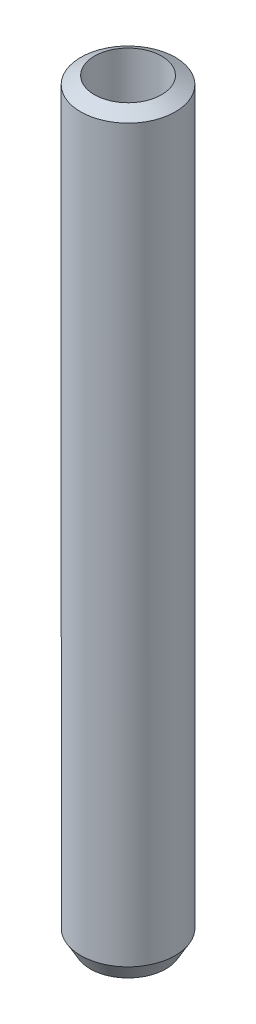
ISO-10303-21;
HEADER;
FILE_DESCRIPTION(('STEP AP214'),'2;1');
FILE_NAME('part.step','',(''),(''),'','','');
FILE_SCHEMA(('AUTOMOTIVE_DESIGN { 1 0 10303 214 1 1 1 1 }'));
ENDSEC;
DATA;
#1=APPLICATION_CONTEXT('core data for automotive mechanical design processes');
#2=APPLICATION_PROTOCOL_DEFINITION('international standard','automotive_design',2000,#1);
#3=PRODUCT_CONTEXT('',#1,'mechanical');
#4=PRODUCT('Part','Part','',(#3));
#5=PRODUCT_RELATED_PRODUCT_CATEGORY('part','',(#4));
#6=PRODUCT_DEFINITION_FORMATION('','',#4);
#7=PRODUCT_DEFINITION_CONTEXT('part definition',#1,'design');
#8=PRODUCT_DEFINITION('design','',#6,#7);
#9=PRODUCT_DEFINITION_SHAPE('','',#8);
#10=(LENGTH_UNIT() NAMED_UNIT(*) SI_UNIT(.MILLI.,.METRE.));
#11=(NAMED_UNIT(*) PLANE_ANGLE_UNIT() SI_UNIT($,.RADIAN.));
#12=(NAMED_UNIT(*) SI_UNIT($,.STERADIAN.) SOLID_ANGLE_UNIT());
#13=UNCERTAINTY_MEASURE_WITH_UNIT(LENGTH_MEASURE(1.E-05),#10,'distance_accuracy_value','');
#14=(GEOMETRIC_REPRESENTATION_CONTEXT(3) GLOBAL_UNCERTAINTY_ASSIGNED_CONTEXT((#13)) GLOBAL_UNIT_ASSIGNED_CONTEXT((#10,
#11,#12)) REPRESENTATION_CONTEXT('',''));
#15=CARTESIAN_POINT('',(0.,0.,0.));
#16=DIRECTION('',(0.,0.,1.));
#17=DIRECTION('',(1.,0.,0.));
#18=AXIS2_PLACEMENT_3D('',#15,#16,#17);
#19=CARTESIAN_POINT('',(0.,279.982262421001,0.));
#20=DIRECTION('',(0.,-1.,0.));
#21=DIRECTION('',(0.,0.,-1.));
#22=AXIS2_PLACEMENT_3D('',#19,#20,#21);
#23=CYLINDRICAL_SURFACE('',#22,17.5);
#24=CARTESIAN_POINT('',(0.,276.491975395049,0.));
#25=DIRECTION('',(0.,1.,0.));
#26=DIRECTION('',(0.,0.,1.));
#27=AXIS2_PLACEMENT_3D('',#24,#25,#26);
#28=CIRCLE('',#27,17.5);
#29=CARTESIAN_POINT('',(0.,276.491975395049,-17.5000000000001));
#30=VERTEX_POINT('',#29);
#31=EDGE_CURVE('E50',#30,#30,#28,.F.);
#32=ORIENTED_EDGE('',*,*,#31,.T.);
#33=EDGE_LOOP('',(#32));
#34=FACE_BOUND('',#33,.T.);
#35=CARTESIAN_POINT('',(0.,6.04535446194748,0.));
#36=DIRECTION('',(0.,1.,0.));
#37=DIRECTION('',(0.,0.,1.));
#38=AXIS2_PLACEMENT_3D('',#35,#36,#37);
#39=CIRCLE('',#38,17.5);
#40=CARTESIAN_POINT('',(0.,6.04535446194748,17.5));
#41=VERTEX_POINT('',#40);
#42=EDGE_CURVE('E51',#41,#41,#39,.T.);
#43=ORIENTED_EDGE('',*,*,#42,.T.);
#44=EDGE_LOOP('',(#43));
#45=FACE_BOUND('',#44,.T.);
#46=ADVANCED_FACE('F39',(#34,#45),#23,.T.);
#47=CARTESIAN_POINT('',(0.,0.,0.));
#48=DIRECTION('',(0.,1.,0.));
#49=DIRECTION('',(0.,0.,1.));
#50=AXIS2_PLACEMENT_3D('',#47,#48,#49);
#51=PLANE('',#50);
#52=CARTESIAN_POINT('',(0.,0.,0.));
#53=DIRECTION('',(0.,1.,0.));
#54=DIRECTION('',(0.,0.,1.));
#55=AXIS2_PLACEMENT_3D('',#52,#53,#54);
#56=CIRCLE('',#55,14.0097129740479);
#57=CARTESIAN_POINT('',(0.,0.,14.0097129740479));
#58=VERTEX_POINT('',#57);
#59=EDGE_CURVE('E10',#58,#58,#56,.F.);
#60=ORIENTED_EDGE('',*,*,#59,.T.);
#61=EDGE_LOOP('',(#60));
#62=FACE_BOUND('',#61,.T.);
#63=CARTESIAN_POINT('',(0.,0.,0.));
#64=DIRECTION('',(0.,1.,0.));
#65=DIRECTION('',(0.,0.,1.));
#66=AXIS2_PLACEMENT_3D('',#63,#64,#65);
#67=CIRCLE('',#66,12.4150690336909);
#68=CARTESIAN_POINT('',(0.,0.,12.4150690336909));
#69=VERTEX_POINT('',#68);
#70=EDGE_CURVE('E58',#69,#69,#67,.T.);
#71=ORIENTED_EDGE('',*,*,#70,.T.);
#72=EDGE_LOOP('',(#71));
#73=FACE_BOUND('',#72,.T.);
#74=ADVANCED_FACE('F62',(#62,#73),#51,.F.);
#75=CARTESIAN_POINT('',(0.,279.982262421001,0.));
#76=DIRECTION('',(0.,-1.,0.));
#77=DIRECTION('',(0.,0.,-1.));
#78=AXIS2_PLACEMENT_3D('',#75,#76,#77);
#79=CYLINDRICAL_SURFACE('',#78,12.4150690336909);
#80=CARTESIAN_POINT('',(0.,279.427761657258,0.));
#81=DIRECTION('',(0.,-1.,0.));
#82=DIRECTION('',(0.,0.,-1.));
#83=AXIS2_PLACEMENT_3D('',#80,#81,#82);
#84=CIRCLE('',#83,12.4150690336909);
#85=CARTESIAN_POINT('',(0.,279.427761657258,-12.4150690336909));
#86=VERTEX_POINT('',#85);
#87=EDGE_CURVE('E54',#86,#86,#84,.F.);
#88=ORIENTED_EDGE('',*,*,#87,.T.);
#89=EDGE_LOOP('',(#88));
#90=FACE_BOUND('',#89,.T.);
#91=ORIENTED_EDGE('',*,*,#70,.F.);
#92=EDGE_LOOP('',(#91));
#93=FACE_BOUND('',#92,.T.);
#94=ADVANCED_FACE('F68',(#90,#93),#79,.F.);
#95=CARTESIAN_POINT('',(0.,279.982262421001,0.));
#96=DIRECTION('',(0.,-1.,0.));
#97=DIRECTION('',(0.,0.,-1.));
#98=AXIS2_PLACEMENT_3D('',#95,#96,#97);
#99=CONICAL_SURFACE('',#98,11.4546455380524,1.0471975511966);
#100=CARTESIAN_POINT('',(0.,276.491975395049,-17.5000000000001));
#101=CARTESIAN_POINT('',(0.,276.522556501947,-17.447031969101));
#102=CARTESIAN_POINT('',(0.,276.553137608845,-17.3940639382019));
#103=CARTESIAN_POINT('',(0.,276.614299822641,-17.2881278764038));
#104=CARTESIAN_POINT('',(0.,276.644880929539,-17.2351598455048));
#105=CARTESIAN_POINT('',(0.,276.706043143335,-17.1292237837067));
#106=CARTESIAN_POINT('',(0.,276.736624250233,-17.0762557528076));
#107=CARTESIAN_POINT('',(0.,276.797786464029,-16.9703196910095));
#108=CARTESIAN_POINT('',(0.,276.828367570927,-16.9173516601105));
#109=CARTESIAN_POINT('',(0.,276.889529784723,-16.8114155983124));
#110=CARTESIAN_POINT('',(0.,276.920110891621,-16.7584475674133));
#111=CARTESIAN_POINT('',(0.,276.981273105417,-16.6525115056152));
#112=CARTESIAN_POINT('',(0.,277.011854212315,-16.5995434747161));
#113=CARTESIAN_POINT('',(0.,277.073016426111,-16.493607412918));
#114=CARTESIAN_POINT('',(0.,277.103597533009,-16.440639382019));
#115=CARTESIAN_POINT('',(0.,277.164759746805,-16.3347033202209));
#116=CARTESIAN_POINT('',(0.,277.195340853703,-16.2817352893218));
#117=CARTESIAN_POINT('',(0.,277.256503067499,-16.1757992275237));
#118=CARTESIAN_POINT('',(0.,277.287084174397,-16.1228311966246));
#119=CARTESIAN_POINT('',(0.,277.348246388194,-16.0168951348265));
#120=CARTESIAN_POINT('',(0.,277.378827495092,-15.9639271039275));
#121=CARTESIAN_POINT('',(0.,277.439989708888,-15.8579910421294));
#122=CARTESIAN_POINT('',(0.,277.470570815786,-15.8050230112303));
#123=CARTESIAN_POINT('',(0.,277.531733029582,-15.6990869494322));
#124=CARTESIAN_POINT('',(0.,277.56231413648,-15.6461189185332));
#125=CARTESIAN_POINT('',(0.,277.623476350276,-15.5401828567351));
#126=CARTESIAN_POINT('',(0.,277.654057457174,-15.487214825836));
#127=CARTESIAN_POINT('',(0.,277.71521967097,-15.3812787640379));
#128=CARTESIAN_POINT('',(0.,277.745800777868,-15.3283107331388));
#129=CARTESIAN_POINT('',(0.,277.806962991664,-15.2223746713407));
#130=CARTESIAN_POINT('',(0.,277.837544098562,-15.1694066404417));
#131=CARTESIAN_POINT('',(0.,277.898706312358,-15.0634705786436));
#132=CARTESIAN_POINT('',(0.,277.929287419256,-15.0105025477445));
#133=CARTESIAN_POINT('',(0.,277.990449633052,-14.9045664859464));
#134=CARTESIAN_POINT('',(0.,278.02103073995,-14.8515984550473));
#135=CARTESIAN_POINT('',(0.,278.082192953746,-14.7456623932492));
#136=CARTESIAN_POINT('',(0.,278.112774060644,-14.6926943623502));
#137=CARTESIAN_POINT('',(0.,278.17393627444,-14.5867583005521));
#138=CARTESIAN_POINT('',(0.,278.204517381338,-14.533790269653));
#139=CARTESIAN_POINT('',(0.,278.265679595134,-14.4278542078549));
#140=CARTESIAN_POINT('',(0.,278.296260702032,-14.3748861769559));
#141=CARTESIAN_POINT('',(0.,278.357422915828,-14.2689501151578));
#142=CARTESIAN_POINT('',(0.,278.388004022726,-14.2159820842587));
#143=CARTESIAN_POINT('',(0.,278.449166236522,-14.1100460224606));
#144=CARTESIAN_POINT('',(0.,278.47974734342,-14.0570779915615));
#145=CARTESIAN_POINT('',(0.,278.540909557216,-13.9511419297634));
#146=CARTESIAN_POINT('',(0.,278.571490664114,-13.8981738988644));
#147=CARTESIAN_POINT('',(0.,278.63265287791,-13.7922378370663));
#148=CARTESIAN_POINT('',(0.,278.663233984808,-13.7392698061672));
#149=CARTESIAN_POINT('',(0.,278.724396198604,-13.6333337443691));
#150=CARTESIAN_POINT('',(0.,278.754977305502,-13.58036571347));
#151=CARTESIAN_POINT('',(0.,278.816139519298,-13.4744296516719));
#152=CARTESIAN_POINT('',(0.,278.846720626196,-13.4214616207729));
#153=CARTESIAN_POINT('',(0.,278.907882839992,-13.3155255589748));
#154=CARTESIAN_POINT('',(0.,278.93846394689,-13.2625575280757));
#155=CARTESIAN_POINT('',(0.,278.999626160686,-13.1566214662776));
#156=CARTESIAN_POINT('',(0.,279.030207267584,-13.1036534353786));
#157=CARTESIAN_POINT('',(0.,279.09136948138,-12.9977173735805));
#158=CARTESIAN_POINT('',(0.,279.121950588278,-12.9447493426814));
#159=CARTESIAN_POINT('',(0.,279.183112802074,-12.8388132808833));
#160=CARTESIAN_POINT('',(0.,279.213693908972,-12.7858452499842));
#161=CARTESIAN_POINT('',(0.,279.274856122768,-12.6799091881861));
#162=CARTESIAN_POINT('',(0.,279.305437229666,-12.6269411572871));
#163=CARTESIAN_POINT('',(0.,279.366599443462,-12.521005095489));
#164=CARTESIAN_POINT('',(0.,279.39718055036,-12.4680370645899));
#165=CARTESIAN_POINT('',(0.,279.427761657258,-12.4150690336909));
#166=B_SPLINE_CURVE_WITH_KNOTS('',3,(#100,#101,#102,#103,#104,#105,#106,#107,#108,#109,#110,
#111,#112,#113,#114,#115,#116,#117,#118,#119,#120,#121,#122,#123,#124,#125,#126,#127,#128,#129,
#130,#131,#132,#133,#134,#135,#136,#137,#138,#139,#140,#141,#142,#143,#144,#145,#146,#147,#148,
#149,#150,#151,#152,#153,#154,#155,#156,#157,#158,#159,#160,#161,#162,#163,#164,#165),
.UNSPECIFIED.,.F.,.F.,(4,2,2,2,2,2,2,2,2,2,2,2,2,2,2,2,2,2,2,2,2,2,2,2,2,2,2,2,2,2,2,2,4),(0.,
0.18348664138806,0.366973282776151,0.550459924164215,0.733946565552303,0.917433206940394,
1.10091984832845,1.28440648971655,1.46789313110464,1.6513797724927,1.83486641388079,
2.01835305526885,2.20183969665694,2.38532633804503,2.56881297943309,2.75229962082118,
2.93578626220927,3.11927290359733,3.30275954498542,3.48624618637348,3.66973282776157,
3.85321946914966,4.03670611053773,4.22019275192581,4.40367939331391,4.58716603470197,
4.77065267609006,4.95413931747812,5.13762595886621,5.3211126002543,5.50459924164236,
5.68808588303045,5.87157252441854),.UNSPECIFIED.);
#167=EDGE_CURVE('BSEAM66',#30,#86,#166,.T.);
#168=ORIENTED_EDGE('',*,*,#31,.F.);
#169=ORIENTED_EDGE('',*,*,#87,.F.);
#170=ORIENTED_EDGE('',*,*,#167,.T.);
#171=ORIENTED_EDGE('',*,*,#167,.F.);
#172=EDGE_LOOP('',(#168,#170,#169,#171));
#173=FACE_BOUND('',#172,.T.);
#174=ADVANCED_FACE('F66',(#173),#99,.T.);
#175=CARTESIAN_POINT('',(0.,6.04535446194748,0.));
#176=DIRECTION('',(0.,1.,0.));
#177=DIRECTION('',(0.,0.,1.));
#178=AXIS2_PLACEMENT_3D('',#175,#176,#177);
#179=CONICAL_SURFACE('',#178,17.5,0.523598775598301);
#180=ORIENTED_EDGE('',*,*,#59,.F.);
#181=EDGE_LOOP('',(#180));
#182=FACE_BOUND('',#181,.T.);
#183=ORIENTED_EDGE('',*,*,#42,.F.);
#184=EDGE_LOOP('',(#183));
#185=FACE_BOUND('',#184,.T.);
#186=ADVANCED_FACE('F45',(#182,#185),#179,.T.);
#187=CLOSED_SHELL('',(#46,#74,#94,#174,#186));
#188=MANIFOLD_SOLID_BREP('B2',#187);
#189=ADVANCED_BREP_SHAPE_REPRESENTATION('',(#18,#188),#14);
#190=SHAPE_DEFINITION_REPRESENTATION(#9,#189);
ENDSEC;
END-ISO-10303-21;
